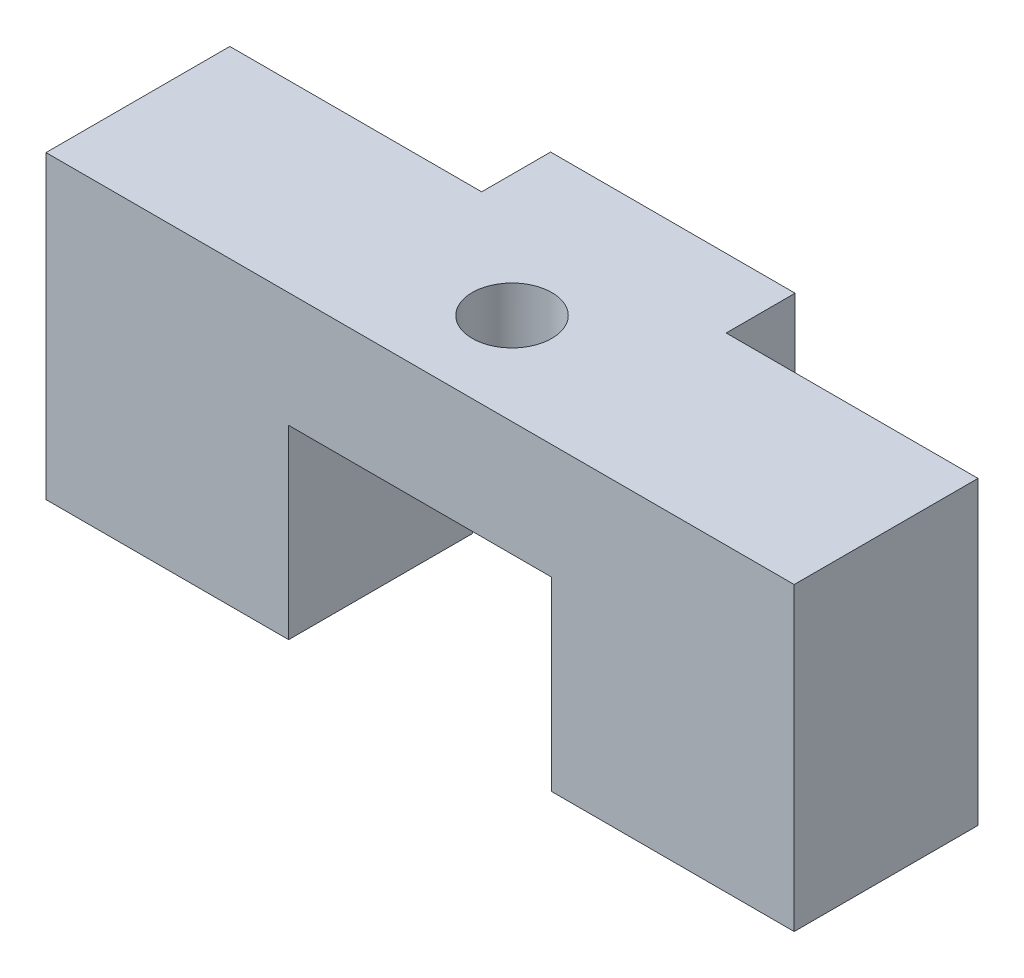
ISO-10303-21;
HEADER;
FILE_DESCRIPTION(('STEP AP214'),'2;1');
FILE_NAME('part.step','',(''),(''),'','','');
FILE_SCHEMA(('AUTOMOTIVE_DESIGN { 1 0 10303 214 1 1 1 1 }'));
ENDSEC;
DATA;
#1=APPLICATION_CONTEXT('core data for automotive mechanical design processes');
#2=APPLICATION_PROTOCOL_DEFINITION('international standard','automotive_design',2000,#1);
#3=PRODUCT_CONTEXT('',#1,'mechanical');
#4=PRODUCT('Part','Part','',(#3));
#5=PRODUCT_RELATED_PRODUCT_CATEGORY('part','',(#4));
#6=PRODUCT_DEFINITION_FORMATION('','',#4);
#7=PRODUCT_DEFINITION_CONTEXT('part definition',#1,'design');
#8=PRODUCT_DEFINITION('design','',#6,#7);
#9=PRODUCT_DEFINITION_SHAPE('','',#8);
#10=(LENGTH_UNIT() NAMED_UNIT(*) SI_UNIT(.MILLI.,.METRE.));
#11=(NAMED_UNIT(*) PLANE_ANGLE_UNIT() SI_UNIT($,.RADIAN.));
#12=(NAMED_UNIT(*) SI_UNIT($,.STERADIAN.) SOLID_ANGLE_UNIT());
#13=UNCERTAINTY_MEASURE_WITH_UNIT(LENGTH_MEASURE(1.E-05),#10,'distance_accuracy_value','');
#14=(GEOMETRIC_REPRESENTATION_CONTEXT(3) GLOBAL_UNCERTAINTY_ASSIGNED_CONTEXT((#13)) GLOBAL_UNIT_ASSIGNED_CONTEXT((#10,
#11,#12)) REPRESENTATION_CONTEXT('',''));
#15=CARTESIAN_POINT('',(0.,0.,0.));
#16=DIRECTION('',(0.,0.,1.));
#17=DIRECTION('',(1.,0.,0.));
#18=AXIS2_PLACEMENT_3D('',#15,#16,#17);
#19=CARTESIAN_POINT('',(0.,0.,0.));
#20=DIRECTION('',(0.,-1.,0.));
#21=DIRECTION('',(0.,0.,-1.));
#22=AXIS2_PLACEMENT_3D('',#19,#20,#21);
#23=PLANE('',#22);
#24=CARTESIAN_POINT('',(10.3378,0.,-2.54));
#25=DIRECTION('',(0.,-1.,0.));
#26=DIRECTION('',(0.,0.,-1.));
#27=AXIS2_PLACEMENT_3D('',#24,#25,#26);
#28=CIRCLE('',#27,1.1);
#29=CARTESIAN_POINT('',(10.3378,0.,-3.64));
#30=VERTEX_POINT('',#29);
#31=EDGE_CURVE('E150',#30,#30,#28,.T.);
#32=ORIENTED_EDGE('',*,*,#31,.F.);
#33=EDGE_LOOP('',(#32));
#34=FACE_BOUND('',#33,.T.);
#35=DIRECTION('',(1.,0.,0.));
#36=VECTOR('',#35,1.);
#37=CARTESIAN_POINT('',(0.,0.,0.));
#38=LINE('',#37,#36);
#39=CARTESIAN_POINT('',(6.7056,0.,0.));
#40=VERTEX_POINT('',#39);
#41=CARTESIAN_POINT('',(13.97,0.,0.));
#42=VERTEX_POINT('',#41);
#43=EDGE_CURVE('E57',#40,#42,#38,.T.);
#44=ORIENTED_EDGE('',*,*,#43,.F.);
#45=DIRECTION('',(0.,0.,1.));
#46=VECTOR('',#45,1.);
#47=CARTESIAN_POINT('',(6.7056,0.,-5.08));
#48=LINE('',#47,#46);
#49=CARTESIAN_POINT('',(6.7056,0.,-5.08));
#50=VERTEX_POINT('',#49);
#51=EDGE_CURVE('E148',#50,#40,#48,.T.);
#52=ORIENTED_EDGE('',*,*,#51,.F.);
#53=DIRECTION('',(1.,0.,0.));
#54=VECTOR('',#53,1.);
#55=CARTESIAN_POINT('',(0.,0.,-5.08));
#56=LINE('',#55,#54);
#57=CARTESIAN_POINT('',(6.9596,0.,-5.08));
#58=VERTEX_POINT('',#57);
#59=EDGE_CURVE('E178',#50,#58,#56,.T.);
#60=ORIENTED_EDGE('',*,*,#59,.T.);
#61=DIRECTION('',(0.,0.,-1.));
#62=VECTOR('',#61,1.);
#63=CARTESIAN_POINT('',(6.9596,0.,-5.08));
#64=LINE('',#63,#62);
#65=CARTESIAN_POINT('',(6.9596,0.,-6.985));
#66=VERTEX_POINT('',#65);
#67=EDGE_CURVE('E198',#58,#66,#64,.T.);
#68=ORIENTED_EDGE('',*,*,#67,.T.);
#69=DIRECTION('',(1.,0.,0.));
#70=VECTOR('',#69,1.);
#71=CARTESIAN_POINT('',(6.9596,0.,-6.985));
#72=LINE('',#71,#70);
#73=CARTESIAN_POINT('',(13.716,0.,-6.985));
#74=VERTEX_POINT('',#73);
#75=EDGE_CURVE('E201',#66,#74,#72,.T.);
#76=ORIENTED_EDGE('',*,*,#75,.T.);
#77=DIRECTION('',(0.,0.,1.));
#78=VECTOR('',#77,1.);
#79=CARTESIAN_POINT('',(13.716,0.,-6.985));
#80=LINE('',#79,#78);
#81=CARTESIAN_POINT('',(13.716,0.,-5.08));
#82=VERTEX_POINT('',#81);
#83=EDGE_CURVE('E204',#74,#82,#80,.T.);
#84=ORIENTED_EDGE('',*,*,#83,.T.);
#85=DIRECTION('',(1.,0.,0.));
#86=VECTOR('',#85,1.);
#87=CARTESIAN_POINT('',(13.716,0.,-5.08));
#88=LINE('',#87,#86);
#89=CARTESIAN_POINT('',(13.97,0.,-5.08));
#90=VERTEX_POINT('',#89);
#91=EDGE_CURVE('E207',#82,#90,#88,.T.);
#92=ORIENTED_EDGE('',*,*,#91,.T.);
#93=DIRECTION('',(0.,0.,-1.));
#94=VECTOR('',#93,1.);
#95=CARTESIAN_POINT('',(13.97,0.,0.));
#96=LINE('',#95,#94);
#97=EDGE_CURVE('E159',#42,#90,#96,.T.);
#98=ORIENTED_EDGE('',*,*,#97,.F.);
#99=EDGE_LOOP('',(#44,#52,#60,#68,#76,#84,#92,#98));
#100=FACE_BOUND('',#99,.T.);
#101=ADVANCED_FACE('F35',(#34,#100),#23,.T.);
#102=CARTESIAN_POINT('',(0.,3.175,0.));
#103=DIRECTION('',(-1.,0.,0.));
#104=DIRECTION('',(0.,0.,1.));
#105=AXIS2_PLACEMENT_3D('',#102,#103,#104);
#106=PLANE('',#105);
#107=DIRECTION('',(0.,-1.,0.));
#108=VECTOR('',#107,1.);
#109=CARTESIAN_POINT('',(0.,3.175,-5.08));
#110=LINE('',#109,#108);
#111=CARTESIAN_POINT('',(0.,3.175,-5.08));
#112=VERTEX_POINT('',#111);
#113=CARTESIAN_POINT('',(0.,-5.1308,-5.08));
#114=VERTEX_POINT('',#113);
#115=EDGE_CURVE('E39',#112,#114,#110,.T.);
#116=ORIENTED_EDGE('',*,*,#115,.T.);
#117=DIRECTION('',(0.,0.,-1.));
#118=VECTOR('',#117,1.);
#119=CARTESIAN_POINT('',(0.,-5.1308,-5.08));
#120=LINE('',#119,#118);
#121=CARTESIAN_POINT('',(0.,-5.1308,0.));
#122=VERTEX_POINT('',#121);
#123=EDGE_CURVE('E128',#122,#114,#120,.T.);
#124=ORIENTED_EDGE('',*,*,#123,.F.);
#125=DIRECTION('',(0.,-1.,0.));
#126=VECTOR('',#125,1.);
#127=CARTESIAN_POINT('',(0.,3.175,0.));
#128=LINE('',#127,#126);
#129=CARTESIAN_POINT('',(0.,3.175,0.));
#130=VERTEX_POINT('',#129);
#131=EDGE_CURVE('E11',#130,#122,#128,.T.);
#132=ORIENTED_EDGE('',*,*,#131,.F.);
#133=DIRECTION('',(0.,0.,-1.));
#134=VECTOR('',#133,1.);
#135=CARTESIAN_POINT('',(0.,3.175,0.));
#136=LINE('',#135,#134);
#137=EDGE_CURVE('E130',#130,#112,#136,.T.);
#138=ORIENTED_EDGE('',*,*,#137,.T.);
#139=EDGE_LOOP('',(#116,#124,#132,#138));
#140=FACE_BOUND('',#139,.T.);
#141=ADVANCED_FACE('F37',(#140),#106,.T.);
#142=CARTESIAN_POINT('',(0.,3.175,0.));
#143=DIRECTION('',(0.,0.,-1.));
#144=DIRECTION('',(-1.,0.,0.));
#145=AXIS2_PLACEMENT_3D('',#142,#143,#144);
#146=PLANE('',#145);
#147=ORIENTED_EDGE('',*,*,#131,.T.);
#148=DIRECTION('',(-1.,0.,0.));
#149=VECTOR('',#148,1.);
#150=CARTESIAN_POINT('',(0.,-5.1308,0.));
#151=LINE('',#150,#149);
#152=CARTESIAN_POINT('',(6.7056,-5.1308,0.));
#153=VERTEX_POINT('',#152);
#154=EDGE_CURVE('E147',#153,#122,#151,.T.);
#155=ORIENTED_EDGE('',*,*,#154,.F.);
#156=DIRECTION('',(0.,1.,0.));
#157=VECTOR('',#156,1.);
#158=CARTESIAN_POINT('',(6.7056,-5.1308,0.));
#159=LINE('',#158,#157);
#160=EDGE_CURVE('E52',#153,#40,#159,.T.);
#161=ORIENTED_EDGE('',*,*,#160,.T.);
#162=ORIENTED_EDGE('',*,*,#43,.T.);
#163=DIRECTION('',(0.,1.,0.));
#164=VECTOR('',#163,1.);
#165=CARTESIAN_POINT('',(13.97,-5.1308,0.));
#166=LINE('',#165,#164);
#167=CARTESIAN_POINT('',(13.97,-5.1308,0.));
#168=VERTEX_POINT('',#167);
#169=EDGE_CURVE('E175',#168,#42,#166,.T.);
#170=ORIENTED_EDGE('',*,*,#169,.F.);
#171=DIRECTION('',(-1.,0.,0.));
#172=VECTOR('',#171,1.);
#173=CARTESIAN_POINT('',(20.6756,-5.1308,0.));
#174=LINE('',#173,#172);
#175=CARTESIAN_POINT('',(20.6756,-5.1308,0.));
#176=VERTEX_POINT('',#175);
#177=EDGE_CURVE('E163',#176,#168,#174,.T.);
#178=ORIENTED_EDGE('',*,*,#177,.F.);
#179=DIRECTION('',(0.,-1.,0.));
#180=VECTOR('',#179,1.);
#181=CARTESIAN_POINT('',(20.6756,3.175,0.));
#182=LINE('',#181,#180);
#183=CARTESIAN_POINT('',(20.6756,3.175,0.));
#184=VERTEX_POINT('',#183);
#185=EDGE_CURVE('E44',#184,#176,#182,.T.);
#186=ORIENTED_EDGE('',*,*,#185,.F.);
#187=DIRECTION('',(1.,0.,0.));
#188=VECTOR('',#187,1.);
#189=CARTESIAN_POINT('',(0.,3.175,0.));
#190=LINE('',#189,#188);
#191=EDGE_CURVE('E135',#130,#184,#190,.T.);
#192=ORIENTED_EDGE('',*,*,#191,.F.);
#193=EDGE_LOOP('',(#147,#155,#161,#162,#170,#178,#186,#192));
#194=FACE_BOUND('',#193,.T.);
#195=ADVANCED_FACE('F228',(#194),#146,.F.);
#196=CARTESIAN_POINT('',(20.6756,3.175,0.));
#197=DIRECTION('',(-1.,0.,0.));
#198=DIRECTION('',(0.,0.,1.));
#199=AXIS2_PLACEMENT_3D('',#196,#197,#198);
#200=PLANE('',#199);
#201=ORIENTED_EDGE('',*,*,#185,.T.);
#202=DIRECTION('',(0.,0.,1.));
#203=VECTOR('',#202,1.);
#204=CARTESIAN_POINT('',(20.6756,-5.1308,0.));
#205=LINE('',#204,#203);
#206=CARTESIAN_POINT('',(20.6756,-5.1308,-5.08));
#207=VERTEX_POINT('',#206);
#208=EDGE_CURVE('E160',#207,#176,#205,.T.);
#209=ORIENTED_EDGE('',*,*,#208,.F.);
#210=DIRECTION('',(0.,-1.,0.));
#211=VECTOR('',#210,1.);
#212=CARTESIAN_POINT('',(20.6756,3.175,-5.08));
#213=LINE('',#212,#211);
#214=CARTESIAN_POINT('',(20.6756,3.175,-5.08));
#215=VERTEX_POINT('',#214);
#216=EDGE_CURVE('E211',#215,#207,#213,.T.);
#217=ORIENTED_EDGE('',*,*,#216,.F.);
#218=DIRECTION('',(0.,0.,-1.));
#219=VECTOR('',#218,1.);
#220=CARTESIAN_POINT('',(20.6756,3.175,0.));
#221=LINE('',#220,#219);
#222=EDGE_CURVE('E194',#184,#215,#221,.T.);
#223=ORIENTED_EDGE('',*,*,#222,.F.);
#224=EDGE_LOOP('',(#201,#209,#217,#223));
#225=FACE_BOUND('',#224,.T.);
#226=ADVANCED_FACE('F256',(#225),#200,.F.);
#227=CARTESIAN_POINT('',(13.716,3.175,-5.08));
#228=DIRECTION('',(0.,0.,-1.));
#229=DIRECTION('',(-1.,0.,0.));
#230=AXIS2_PLACEMENT_3D('',#227,#228,#229);
#231=PLANE('',#230);
#232=ORIENTED_EDGE('',*,*,#91,.F.);
#233=DIRECTION('',(0.,-1.,0.));
#234=VECTOR('',#233,1.);
#235=CARTESIAN_POINT('',(13.716,3.175,-5.08));
#236=LINE('',#235,#234);
#237=CARTESIAN_POINT('',(13.716,3.175,-5.08));
#238=VERTEX_POINT('',#237);
#239=EDGE_CURVE('E213',#238,#82,#236,.T.);
#240=ORIENTED_EDGE('',*,*,#239,.F.);
#241=DIRECTION('',(1.,0.,0.));
#242=VECTOR('',#241,1.);
#243=CARTESIAN_POINT('',(13.716,3.175,-5.08));
#244=LINE('',#243,#242);
#245=EDGE_CURVE('E191',#238,#215,#244,.T.);
#246=ORIENTED_EDGE('',*,*,#245,.T.);
#247=ORIENTED_EDGE('',*,*,#216,.T.);
#248=DIRECTION('',(1.,0.,0.));
#249=VECTOR('',#248,1.);
#250=CARTESIAN_POINT('',(20.6756,-5.1308,-5.08));
#251=LINE('',#250,#249);
#252=CARTESIAN_POINT('',(13.97,-5.1308,-5.08));
#253=VERTEX_POINT('',#252);
#254=EDGE_CURVE('E167',#253,#207,#251,.T.);
#255=ORIENTED_EDGE('',*,*,#254,.F.);
#256=DIRECTION('',(0.,1.,0.));
#257=VECTOR('',#256,1.);
#258=CARTESIAN_POINT('',(13.97,-5.1308,-5.08));
#259=LINE('',#258,#257);
#260=EDGE_CURVE('E170',#253,#90,#259,.T.);
#261=ORIENTED_EDGE('',*,*,#260,.T.);
#262=EDGE_LOOP('',(#232,#240,#246,#247,#255,#261));
#263=FACE_BOUND('',#262,.T.);
#264=ADVANCED_FACE('F250',(#263),#231,.T.);
#265=CARTESIAN_POINT('',(13.716,3.175,-6.985));
#266=DIRECTION('',(1.,0.,0.));
#267=DIRECTION('',(0.,0.,-1.));
#268=AXIS2_PLACEMENT_3D('',#265,#266,#267);
#269=PLANE('',#268);
#270=ORIENTED_EDGE('',*,*,#83,.F.);
#271=DIRECTION('',(0.,-1.,0.));
#272=VECTOR('',#271,1.);
#273=CARTESIAN_POINT('',(13.716,3.175,-6.985));
#274=LINE('',#273,#272);
#275=CARTESIAN_POINT('',(13.716,3.175,-6.985));
#276=VERTEX_POINT('',#275);
#277=EDGE_CURVE('E215',#276,#74,#274,.T.);
#278=ORIENTED_EDGE('',*,*,#277,.F.);
#279=DIRECTION('',(0.,0.,1.));
#280=VECTOR('',#279,1.);
#281=CARTESIAN_POINT('',(13.716,3.175,-6.985));
#282=LINE('',#281,#280);
#283=EDGE_CURVE('E188',#276,#238,#282,.T.);
#284=ORIENTED_EDGE('',*,*,#283,.T.);
#285=ORIENTED_EDGE('',*,*,#239,.T.);
#286=EDGE_LOOP('',(#270,#278,#284,#285));
#287=FACE_BOUND('',#286,.T.);
#288=ADVANCED_FACE('F242',(#287),#269,.T.);
#289=CARTESIAN_POINT('',(6.9596,3.175,-6.985));
#290=DIRECTION('',(0.,0.,-1.));
#291=DIRECTION('',(-1.,0.,0.));
#292=AXIS2_PLACEMENT_3D('',#289,#290,#291);
#293=PLANE('',#292);
#294=ORIENTED_EDGE('',*,*,#75,.F.);
#295=DIRECTION('',(0.,-1.,0.));
#296=VECTOR('',#295,1.);
#297=CARTESIAN_POINT('',(6.9596,3.175,-6.985));
#298=LINE('',#297,#296);
#299=CARTESIAN_POINT('',(6.9596,3.175,-6.985));
#300=VERTEX_POINT('',#299);
#301=EDGE_CURVE('E217',#300,#66,#298,.T.);
#302=ORIENTED_EDGE('',*,*,#301,.F.);
#303=DIRECTION('',(1.,0.,0.));
#304=VECTOR('',#303,1.);
#305=CARTESIAN_POINT('',(6.9596,3.175,-6.985));
#306=LINE('',#305,#304);
#307=EDGE_CURVE('E185',#300,#276,#306,.T.);
#308=ORIENTED_EDGE('',*,*,#307,.T.);
#309=ORIENTED_EDGE('',*,*,#277,.T.);
#310=EDGE_LOOP('',(#294,#302,#308,#309));
#311=FACE_BOUND('',#310,.T.);
#312=ADVANCED_FACE('F239',(#311),#293,.T.);
#313=CARTESIAN_POINT('',(6.9596,3.175,-5.08));
#314=DIRECTION('',(-1.,0.,0.));
#315=DIRECTION('',(0.,0.,1.));
#316=AXIS2_PLACEMENT_3D('',#313,#314,#315);
#317=PLANE('',#316);
#318=ORIENTED_EDGE('',*,*,#67,.F.);
#319=DIRECTION('',(0.,-1.,0.));
#320=VECTOR('',#319,1.);
#321=CARTESIAN_POINT('',(6.9596,3.175,-5.08));
#322=LINE('',#321,#320);
#323=CARTESIAN_POINT('',(6.9596,3.175,-5.08));
#324=VERTEX_POINT('',#323);
#325=EDGE_CURVE('E134',#324,#58,#322,.T.);
#326=ORIENTED_EDGE('',*,*,#325,.F.);
#327=DIRECTION('',(0.,0.,-1.));
#328=VECTOR('',#327,1.);
#329=CARTESIAN_POINT('',(6.9596,3.175,-5.08));
#330=LINE('',#329,#328);
#331=EDGE_CURVE('E182',#324,#300,#330,.T.);
#332=ORIENTED_EDGE('',*,*,#331,.T.);
#333=ORIENTED_EDGE('',*,*,#301,.T.);
#334=EDGE_LOOP('',(#318,#326,#332,#333));
#335=FACE_BOUND('',#334,.T.);
#336=ADVANCED_FACE('F222',(#335),#317,.T.);
#337=CARTESIAN_POINT('',(0.,3.175,-5.08));
#338=DIRECTION('',(0.,0.,-1.));
#339=DIRECTION('',(-1.,0.,0.));
#340=AXIS2_PLACEMENT_3D('',#337,#338,#339);
#341=PLANE('',#340);
#342=ORIENTED_EDGE('',*,*,#59,.F.);
#343=DIRECTION('',(0.,1.,0.));
#344=VECTOR('',#343,1.);
#345=CARTESIAN_POINT('',(6.7056,-5.1308,-5.08));
#346=LINE('',#345,#344);
#347=CARTESIAN_POINT('',(6.7056,-5.1308,-5.08));
#348=VERTEX_POINT('',#347);
#349=EDGE_CURVE('E140',#348,#50,#346,.T.);
#350=ORIENTED_EDGE('',*,*,#349,.F.);
#351=DIRECTION('',(1.,0.,0.));
#352=VECTOR('',#351,1.);
#353=CARTESIAN_POINT('',(0.,-5.1308,-5.08));
#354=LINE('',#353,#352);
#355=EDGE_CURVE('E137',#114,#348,#354,.T.);
#356=ORIENTED_EDGE('',*,*,#355,.F.);
#357=ORIENTED_EDGE('',*,*,#115,.F.);
#358=DIRECTION('',(1.,0.,0.));
#359=VECTOR('',#358,1.);
#360=CARTESIAN_POINT('',(0.,3.175,-5.08));
#361=LINE('',#360,#359);
#362=EDGE_CURVE('E180',#112,#324,#361,.T.);
#363=ORIENTED_EDGE('',*,*,#362,.T.);
#364=ORIENTED_EDGE('',*,*,#325,.T.);
#365=EDGE_LOOP('',(#342,#350,#356,#357,#363,#364));
#366=FACE_BOUND('',#365,.T.);
#367=ADVANCED_FACE('F139',(#366),#341,.T.);
#368=CARTESIAN_POINT('',(0.,3.175,0.));
#369=DIRECTION('',(0.,-1.,0.));
#370=DIRECTION('',(0.,0.,-1.));
#371=AXIS2_PLACEMENT_3D('',#368,#369,#370);
#372=PLANE('',#371);
#373=CARTESIAN_POINT('',(10.3378,3.175,-2.54));
#374=DIRECTION('',(0.,1.,0.));
#375=DIRECTION('',(0.,0.,1.));
#376=AXIS2_PLACEMENT_3D('',#373,#374,#375);
#377=CIRCLE('',#376,1.1);
#378=CARTESIAN_POINT('',(10.3378,3.175,-1.44));
#379=VERTEX_POINT('',#378);
#380=EDGE_CURVE('E293',#379,#379,#377,.T.);
#381=ORIENTED_EDGE('',*,*,#380,.F.);
#382=EDGE_LOOP('',(#381));
#383=FACE_BOUND('',#382,.T.);
#384=ORIENTED_EDGE('',*,*,#137,.F.);
#385=ORIENTED_EDGE('',*,*,#191,.T.);
#386=ORIENTED_EDGE('',*,*,#222,.T.);
#387=ORIENTED_EDGE('',*,*,#245,.F.);
#388=ORIENTED_EDGE('',*,*,#283,.F.);
#389=ORIENTED_EDGE('',*,*,#307,.F.);
#390=ORIENTED_EDGE('',*,*,#331,.F.);
#391=ORIENTED_EDGE('',*,*,#362,.F.);
#392=EDGE_LOOP('',(#384,#385,#386,#387,#388,#389,#390,#391));
#393=FACE_BOUND('',#392,.T.);
#394=ADVANCED_FACE('F234',(#383,#393),#372,.F.);
#395=CARTESIAN_POINT('',(13.97,-5.1308,0.));
#396=DIRECTION('',(1.,0.,0.));
#397=DIRECTION('',(0.,0.,-1.));
#398=AXIS2_PLACEMENT_3D('',#395,#396,#397);
#399=PLANE('',#398);
#400=ORIENTED_EDGE('',*,*,#97,.T.);
#401=ORIENTED_EDGE('',*,*,#260,.F.);
#402=DIRECTION('',(0.,0.,-1.));
#403=VECTOR('',#402,1.);
#404=CARTESIAN_POINT('',(13.97,-5.1308,0.));
#405=LINE('',#404,#403);
#406=EDGE_CURVE('E165',#168,#253,#405,.T.);
#407=ORIENTED_EDGE('',*,*,#406,.F.);
#408=ORIENTED_EDGE('',*,*,#169,.T.);
#409=EDGE_LOOP('',(#400,#401,#407,#408));
#410=FACE_BOUND('',#409,.T.);
#411=ADVANCED_FACE('F247',(#410),#399,.F.);
#412=CARTESIAN_POINT('',(0.,-5.1308,0.));
#413=DIRECTION('',(0.,1.,0.));
#414=DIRECTION('',(0.,0.,1.));
#415=AXIS2_PLACEMENT_3D('',#412,#413,#414);
#416=PLANE('',#415);
#417=ORIENTED_EDGE('',*,*,#208,.T.);
#418=ORIENTED_EDGE('',*,*,#177,.T.);
#419=ORIENTED_EDGE('',*,*,#406,.T.);
#420=ORIENTED_EDGE('',*,*,#254,.T.);
#421=EDGE_LOOP('',(#417,#418,#419,#420));
#422=FACE_BOUND('',#421,.T.);
#423=ADVANCED_FACE('F254',(#422),#416,.F.);
#424=CARTESIAN_POINT('',(6.7056,-5.1308,-5.08));
#425=DIRECTION('',(-1.,0.,0.));
#426=DIRECTION('',(0.,0.,1.));
#427=AXIS2_PLACEMENT_3D('',#424,#425,#426);
#428=PLANE('',#427);
#429=ORIENTED_EDGE('',*,*,#51,.T.);
#430=ORIENTED_EDGE('',*,*,#160,.F.);
#431=DIRECTION('',(0.,0.,1.));
#432=VECTOR('',#431,1.);
#433=CARTESIAN_POINT('',(6.7056,-5.1308,-5.08));
#434=LINE('',#433,#432);
#435=EDGE_CURVE('E143',#348,#153,#434,.T.);
#436=ORIENTED_EDGE('',*,*,#435,.F.);
#437=ORIENTED_EDGE('',*,*,#349,.T.);
#438=EDGE_LOOP('',(#429,#430,#436,#437));
#439=FACE_BOUND('',#438,.T.);
#440=ADVANCED_FACE('F227',(#439),#428,.F.);
#441=CARTESIAN_POINT('',(0.,-5.1308,0.));
#442=DIRECTION('',(0.,1.,0.));
#443=DIRECTION('',(0.,0.,1.));
#444=AXIS2_PLACEMENT_3D('',#441,#442,#443);
#445=PLANE('',#444);
#446=ORIENTED_EDGE('',*,*,#123,.T.);
#447=ORIENTED_EDGE('',*,*,#355,.T.);
#448=ORIENTED_EDGE('',*,*,#435,.T.);
#449=ORIENTED_EDGE('',*,*,#154,.T.);
#450=EDGE_LOOP('',(#446,#447,#448,#449));
#451=FACE_BOUND('',#450,.T.);
#452=ADVANCED_FACE('F146',(#451),#445,.F.);
#453=CARTESIAN_POINT('',(10.3378,3.175,-2.54));
#454=DIRECTION('',(0.,1.,0.));
#455=DIRECTION('',(0.,0.,1.));
#456=AXIS2_PLACEMENT_3D('',#453,#454,#455);
#457=CYLINDRICAL_SURFACE('',#456,1.1);
#458=ORIENTED_EDGE('',*,*,#31,.T.);
#459=EDGE_LOOP('',(#458));
#460=FACE_BOUND('',#459,.T.);
#461=ORIENTED_EDGE('',*,*,#380,.T.);
#462=EDGE_LOOP('',(#461));
#463=FACE_BOUND('',#462,.T.);
#464=ADVANCED_FACE('F284',(#460,#463),#457,.F.);
#465=CLOSED_SHELL('',(#101,#141,#195,#226,#264,#288,#312,#336,#367,#394,#411,#423,#440,#452,#464));
#466=MANIFOLD_SOLID_BREP('B2',#465);
#467=ADVANCED_BREP_SHAPE_REPRESENTATION('',(#18,#466),#14);
#468=SHAPE_DEFINITION_REPRESENTATION(#9,#467);
ENDSEC;
END-ISO-10303-21;
